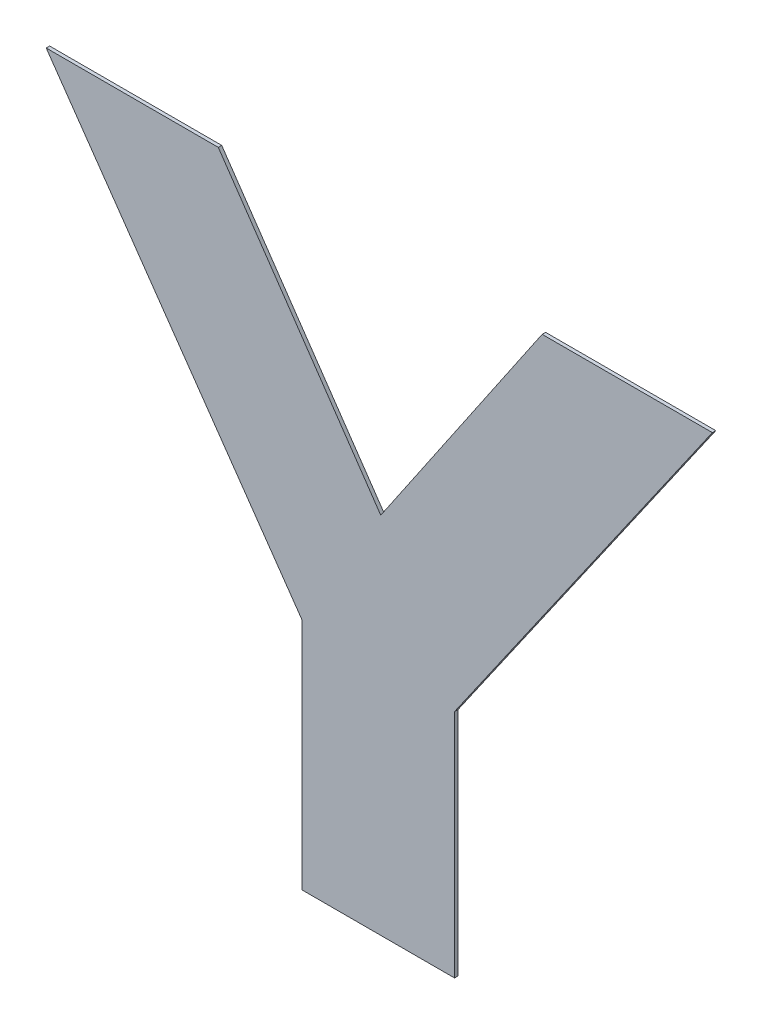
ISO-10303-21;
HEADER;
FILE_DESCRIPTION(('STEP AP214'),'2;1');
FILE_NAME('part.step','',(''),(''),'','','');
FILE_SCHEMA(('AUTOMOTIVE_DESIGN { 1 0 10303 214 1 1 1 1 }'));
ENDSEC;
DATA;
#1=APPLICATION_CONTEXT('core data for automotive mechanical design processes');
#2=APPLICATION_PROTOCOL_DEFINITION('international standard','automotive_design',2000,#1);
#3=PRODUCT_CONTEXT('',#1,'mechanical');
#4=PRODUCT('Part','Part','',(#3));
#5=PRODUCT_RELATED_PRODUCT_CATEGORY('part','',(#4));
#6=PRODUCT_DEFINITION_FORMATION('','',#4);
#7=PRODUCT_DEFINITION_CONTEXT('part definition',#1,'design');
#8=PRODUCT_DEFINITION('design','',#6,#7);
#9=PRODUCT_DEFINITION_SHAPE('','',#8);
#10=(LENGTH_UNIT() NAMED_UNIT(*) SI_UNIT(.MILLI.,.METRE.));
#11=(NAMED_UNIT(*) PLANE_ANGLE_UNIT() SI_UNIT($,.RADIAN.));
#12=(NAMED_UNIT(*) SI_UNIT($,.STERADIAN.) SOLID_ANGLE_UNIT());
#13=UNCERTAINTY_MEASURE_WITH_UNIT(LENGTH_MEASURE(1.E-05),#10,'distance_accuracy_value','');
#14=(GEOMETRIC_REPRESENTATION_CONTEXT(3) GLOBAL_UNCERTAINTY_ASSIGNED_CONTEXT((#13)) GLOBAL_UNIT_ASSIGNED_CONTEXT((#10,
#11,#12)) REPRESENTATION_CONTEXT('',''));
#15=CARTESIAN_POINT('',(0.,0.,0.));
#16=DIRECTION('',(0.,0.,1.));
#17=DIRECTION('',(1.,0.,0.));
#18=AXIS2_PLACEMENT_3D('',#15,#16,#17);
#19=CARTESIAN_POINT('',(0.103085676726,0.828015578792025,0.00045));
#20=DIRECTION('',(-0.820629637441726,-0.571460408210631,0.));
#21=DIRECTION('',(0.,0.,1.));
#22=AXIS2_PLACEMENT_3D('',#19,#20,#21);
#23=PLANE('',#22);
#24=DIRECTION('',(0.,0.,1.));
#25=VECTOR('',#24,1.);
#26=CARTESIAN_POINT('',(0.119836789401,0.803960614837,0.));
#27=LINE('',#26,#25);
#28=CARTESIAN_POINT('',(0.119836789401,0.803960614837,0.));
#29=VERTEX_POINT('',#28);
#30=CARTESIAN_POINT('',(0.119836789401,0.803960614837,0.00045));
#31=VERTEX_POINT('',#30);
#32=EDGE_CURVE('E11',#29,#31,#27,.T.);
#33=ORIENTED_EDGE('',*,*,#32,.T.);
#34=DIRECTION('',(-0.571460408210632,0.820629637441726,0.));
#35=VECTOR('',#34,1.);
#36=CARTESIAN_POINT('',(0.119836789401,0.803960614837,0.00045));
#37=LINE('',#36,#35);
#38=CARTESIAN_POINT('',(0.0863345640509998,0.85207054274705,0.00045));
#39=VERTEX_POINT('',#38);
#40=EDGE_CURVE('E157',#31,#39,#37,.T.);
#41=ORIENTED_EDGE('',*,*,#40,.T.);
#42=DIRECTION('',(0.,0.,1.));
#43=VECTOR('',#42,1.);
#44=CARTESIAN_POINT('',(0.0863345640509998,0.85207054274705,0.));
#45=LINE('',#44,#43);
#46=CARTESIAN_POINT('',(0.0863345640509998,0.85207054274705,0.));
#47=VERTEX_POINT('',#46);
#48=EDGE_CURVE('E24',#47,#39,#45,.T.);
#49=ORIENTED_EDGE('',*,*,#48,.F.);
#50=DIRECTION('',(-0.571460408210632,0.820629637441726,0.));
#51=VECTOR('',#50,1.);
#52=CARTESIAN_POINT('',(0.119836789401,0.803960614837,0.));
#53=LINE('',#52,#51);
#54=EDGE_CURVE('E146',#29,#47,#53,.T.);
#55=ORIENTED_EDGE('',*,*,#54,.F.);
#56=EDGE_LOOP('',(#33,#41,#49,#55));
#57=FACE_BOUND('',#56,.T.);
#58=ADVANCED_FACE('F17',(#57),#23,.T.);
#59=CARTESIAN_POINT('',(0.0976103257259998,0.85207054274705,0.00045));
#60=DIRECTION('',(0.,1.,0.));
#61=DIRECTION('',(0.,0.,1.));
#62=AXIS2_PLACEMENT_3D('',#59,#60,#61);
#63=PLANE('',#62);
#64=ORIENTED_EDGE('',*,*,#48,.T.);
#65=DIRECTION('',(1.,0.,0.));
#66=VECTOR('',#65,1.);
#67=CARTESIAN_POINT('',(0.0863345640509998,0.85207054274705,0.00045));
#68=LINE('',#67,#66);
#69=CARTESIAN_POINT('',(0.108886087401,0.85207054274705,0.00045));
#70=VERTEX_POINT('',#69);
#71=EDGE_CURVE('E153',#39,#70,#68,.T.);
#72=ORIENTED_EDGE('',*,*,#71,.T.);
#73=DIRECTION('',(0.,0.,1.));
#74=VECTOR('',#73,1.);
#75=CARTESIAN_POINT('',(0.108886087401,0.85207054274705,0.));
#76=LINE('',#75,#74);
#77=CARTESIAN_POINT('',(0.108886087401,0.85207054274705,0.));
#78=VERTEX_POINT('',#77);
#79=EDGE_CURVE('E155',#78,#70,#76,.T.);
#80=ORIENTED_EDGE('',*,*,#79,.F.);
#81=DIRECTION('',(1.,0.,0.));
#82=VECTOR('',#81,1.);
#83=CARTESIAN_POINT('',(0.0863345640509998,0.85207054274705,0.));
#84=LINE('',#83,#82);
#85=EDGE_CURVE('E138',#47,#78,#84,.T.);
#86=ORIENTED_EDGE('',*,*,#85,.F.);
#87=EDGE_LOOP('',(#64,#72,#80,#86));
#88=FACE_BOUND('',#87,.T.);
#89=ADVANCED_FACE('F164',(#88),#63,.T.);
#90=CARTESIAN_POINT('',(0.119532033851025,0.836518114809525,0.00045));
#91=DIRECTION('',(0.8251882666148,0.564857791520363,0.));
#92=DIRECTION('',(0.,0.,-1.));
#93=AXIS2_PLACEMENT_3D('',#90,#91,#92);
#94=PLANE('',#93);
#95=ORIENTED_EDGE('',*,*,#79,.T.);
#96=DIRECTION('',(0.564857791520364,-0.825188266614799,0.));
#97=VECTOR('',#96,1.);
#98=CARTESIAN_POINT('',(0.108886087401,0.85207054274705,0.00045));
#99=LINE('',#98,#97);
#100=CARTESIAN_POINT('',(0.13017798030105,0.820965686872,0.00045));
#101=VERTEX_POINT('',#100);
#102=EDGE_CURVE('E148',#70,#101,#99,.T.);
#103=ORIENTED_EDGE('',*,*,#102,.T.);
#104=DIRECTION('',(0.,0.,1.));
#105=VECTOR('',#104,1.);
#106=CARTESIAN_POINT('',(0.13017798030105,0.820965686872,0.));
#107=LINE('',#106,#105);
#108=CARTESIAN_POINT('',(0.13017798030105,0.820965686872,0.));
#109=VERTEX_POINT('',#108);
#110=EDGE_CURVE('E151',#109,#101,#107,.T.);
#111=ORIENTED_EDGE('',*,*,#110,.F.);
#112=DIRECTION('',(0.564857791520364,-0.825188266614799,0.));
#113=VECTOR('',#112,1.);
#114=CARTESIAN_POINT('',(0.108886087401,0.85207054274705,0.));
#115=LINE('',#114,#113);
#116=EDGE_CURVE('E130',#78,#109,#115,.T.);
#117=ORIENTED_EDGE('',*,*,#116,.F.);
#118=EDGE_LOOP('',(#95,#103,#111,#117));
#119=FACE_BOUND('',#118,.T.);
#120=ADVANCED_FACE('F167',(#119),#94,.T.);
#121=CARTESIAN_POINT('',(0.140752819451025,0.836518114809525,0.00045));
#122=DIRECTION('',(-0.826946573811709,0.562280503006352,0.));
#123=DIRECTION('',(0.,0.,1.));
#124=AXIS2_PLACEMENT_3D('',#121,#122,#123);
#125=PLANE('',#124);
#126=ORIENTED_EDGE('',*,*,#110,.T.);
#127=DIRECTION('',(0.562280503006353,0.826946573811708,0.));
#128=VECTOR('',#127,1.);
#129=CARTESIAN_POINT('',(0.13017798030105,0.820965686872,0.00045));
#130=LINE('',#129,#128);
#131=CARTESIAN_POINT('',(0.151327658601,0.85207054274705,0.00045));
#132=VERTEX_POINT('',#131);
#133=EDGE_CURVE('E141',#101,#132,#130,.T.);
#134=ORIENTED_EDGE('',*,*,#133,.T.);
#135=DIRECTION('',(0.,0.,1.));
#136=VECTOR('',#135,1.);
#137=CARTESIAN_POINT('',(0.151327658601,0.85207054274705,0.));
#138=LINE('',#137,#136);
#139=CARTESIAN_POINT('',(0.151327658601,0.85207054274705,0.));
#140=VERTEX_POINT('',#139);
#141=EDGE_CURVE('E144',#140,#132,#138,.T.);
#142=ORIENTED_EDGE('',*,*,#141,.F.);
#143=DIRECTION('',(0.562280503006353,0.826946573811708,0.));
#144=VECTOR('',#143,1.);
#145=CARTESIAN_POINT('',(0.13017798030105,0.820965686872,0.));
#146=LINE('',#145,#144);
#147=EDGE_CURVE('E122',#109,#140,#146,.T.);
#148=ORIENTED_EDGE('',*,*,#147,.F.);
#149=EDGE_LOOP('',(#126,#134,#142,#148));
#150=FACE_BOUND('',#149,.T.);
#151=ADVANCED_FACE('F171',(#150),#125,.T.);
#152=CARTESIAN_POINT('',(0.162481522500975,0.85207054274705,0.00045));
#153=DIRECTION('',(0.,1.,0.));
#154=DIRECTION('',(0.,0.,1.));
#155=AXIS2_PLACEMENT_3D('',#152,#153,#154);
#156=PLANE('',#155);
#157=ORIENTED_EDGE('',*,*,#141,.T.);
#158=DIRECTION('',(1.,0.,0.));
#159=VECTOR('',#158,1.);
#160=CARTESIAN_POINT('',(0.151327658601,0.85207054274705,0.00045));
#161=LINE('',#160,#159);
#162=CARTESIAN_POINT('',(0.17363538640095,0.85207054274705,0.00045));
#163=VERTEX_POINT('',#162);
#164=EDGE_CURVE('E133',#132,#163,#161,.T.);
#165=ORIENTED_EDGE('',*,*,#164,.T.);
#166=DIRECTION('',(0.,0.,1.));
#167=VECTOR('',#166,1.);
#168=CARTESIAN_POINT('',(0.17363538640095,0.85207054274705,0.));
#169=LINE('',#168,#167);
#170=CARTESIAN_POINT('',(0.17363538640095,0.85207054274705,0.));
#171=VERTEX_POINT('',#170);
#172=EDGE_CURVE('E136',#171,#163,#169,.T.);
#173=ORIENTED_EDGE('',*,*,#172,.F.);
#174=DIRECTION('',(1.,0.,0.));
#175=VECTOR('',#174,1.);
#176=CARTESIAN_POINT('',(0.151327658601,0.85207054274705,0.));
#177=LINE('',#176,#175);
#178=EDGE_CURVE('E95',#140,#171,#177,.T.);
#179=ORIENTED_EDGE('',*,*,#178,.F.);
#180=EDGE_LOOP('',(#157,#165,#173,#179));
#181=FACE_BOUND('',#180,.T.);
#182=ADVANCED_FACE('F174',(#181),#156,.T.);
#183=CARTESIAN_POINT('',(0.15674205595095,0.827792095304524,0.00045));
#184=DIRECTION('',(0.820842183617819,-0.571155066154131,0.));
#185=DIRECTION('',(0.,0.,-1.));
#186=AXIS2_PLACEMENT_3D('',#183,#184,#185);
#187=PLANE('',#186);
#188=ORIENTED_EDGE('',*,*,#172,.T.);
#189=DIRECTION('',(-0.571155066154132,-0.820842183617819,0.));
#190=VECTOR('',#189,1.);
#191=CARTESIAN_POINT('',(0.17363538640095,0.85207054274705,0.00045));
#192=LINE('',#191,#190);
#193=CARTESIAN_POINT('',(0.13984872550095,0.803513647861999,0.00045));
#194=VERTEX_POINT('',#193);
#195=EDGE_CURVE('E125',#163,#194,#192,.T.);
#196=ORIENTED_EDGE('',*,*,#195,.T.);
#197=DIRECTION('',(0.,0.,1.));
#198=VECTOR('',#197,1.);
#199=CARTESIAN_POINT('',(0.13984872550095,0.803513647861999,0.));
#200=LINE('',#199,#198);
#201=CARTESIAN_POINT('',(0.13984872550095,0.803513647861999,0.));
#202=VERTEX_POINT('',#201);
#203=EDGE_CURVE('E128',#202,#194,#200,.T.);
#204=ORIENTED_EDGE('',*,*,#203,.F.);
#205=DIRECTION('',(-0.571155066154132,-0.820842183617819,0.));
#206=VECTOR('',#205,1.);
#207=CARTESIAN_POINT('',(0.17363538640095,0.85207054274705,0.));
#208=LINE('',#207,#206);
#209=EDGE_CURVE('E112',#171,#202,#208,.T.);
#210=ORIENTED_EDGE('',*,*,#209,.F.);
#211=EDGE_LOOP('',(#188,#196,#204,#210));
#212=FACE_BOUND('',#211,.T.);
#213=ADVANCED_FACE('F178',(#212),#187,.T.);
#214=CARTESIAN_POINT('',(0.13984872550095,0.788397013121974,0.00045));
#215=DIRECTION('',(1.,0.,0.));
#216=DIRECTION('',(0.,0.,-1.));
#217=AXIS2_PLACEMENT_3D('',#214,#215,#216);
#218=PLANE('',#217);
#219=ORIENTED_EDGE('',*,*,#203,.T.);
#220=DIRECTION('',(0.,-1.,0.));
#221=VECTOR('',#220,1.);
#222=CARTESIAN_POINT('',(0.13984872550095,0.803513647861999,0.00045));
#223=LINE('',#222,#221);
#224=CARTESIAN_POINT('',(0.13984872550095,0.77328037838195,0.00045));
#225=VERTEX_POINT('',#224);
#226=EDGE_CURVE('E117',#194,#225,#223,.T.);
#227=ORIENTED_EDGE('',*,*,#226,.T.);
#228=DIRECTION('',(0.,0.,1.));
#229=VECTOR('',#228,1.);
#230=CARTESIAN_POINT('',(0.13984872550095,0.77328037838195,0.));
#231=LINE('',#230,#229);
#232=CARTESIAN_POINT('',(0.13984872550095,0.77328037838195,0.));
#233=VERTEX_POINT('',#232);
#234=EDGE_CURVE('E120',#233,#225,#231,.T.);
#235=ORIENTED_EDGE('',*,*,#234,.F.);
#236=DIRECTION('',(0.,-1.,0.));
#237=VECTOR('',#236,1.);
#238=CARTESIAN_POINT('',(0.13984872550095,0.803513647861999,0.));
#239=LINE('',#238,#237);
#240=EDGE_CURVE('E106',#202,#233,#239,.T.);
#241=ORIENTED_EDGE('',*,*,#240,.F.);
#242=EDGE_LOOP('',(#219,#227,#235,#241));
#243=FACE_BOUND('',#242,.T.);
#244=ADVANCED_FACE('F181',(#243),#218,.T.);
#245=CARTESIAN_POINT('',(0.129842757450975,0.77328037838195,0.00045));
#246=DIRECTION('',(0.,-1.,0.));
#247=DIRECTION('',(0.,0.,-1.));
#248=AXIS2_PLACEMENT_3D('',#245,#246,#247);
#249=PLANE('',#248);
#250=ORIENTED_EDGE('',*,*,#234,.T.);
#251=DIRECTION('',(-1.,0.,0.));
#252=VECTOR('',#251,1.);
#253=CARTESIAN_POINT('',(0.13984872550095,0.77328037838195,0.00045));
#254=LINE('',#253,#252);
#255=CARTESIAN_POINT('',(0.119836789401,0.77328037838195,0.00045));
#256=VERTEX_POINT('',#255);
#257=EDGE_CURVE('E92',#225,#256,#254,.T.);
#258=ORIENTED_EDGE('',*,*,#257,.T.);
#259=DIRECTION('',(0.,0.,1.));
#260=VECTOR('',#259,1.);
#261=CARTESIAN_POINT('',(0.119836789401,0.77328037838195,0.));
#262=LINE('',#261,#260);
#263=CARTESIAN_POINT('',(0.119836789401,0.77328037838195,0.));
#264=VERTEX_POINT('',#263);
#265=EDGE_CURVE('E85',#264,#256,#262,.T.);
#266=ORIENTED_EDGE('',*,*,#265,.F.);
#267=DIRECTION('',(-1.,0.,0.));
#268=VECTOR('',#267,1.);
#269=CARTESIAN_POINT('',(0.13984872550095,0.77328037838195,0.));
#270=LINE('',#269,#268);
#271=EDGE_CURVE('E89',#233,#264,#270,.T.);
#272=ORIENTED_EDGE('',*,*,#271,.F.);
#273=EDGE_LOOP('',(#250,#258,#266,#272));
#274=FACE_BOUND('',#273,.T.);
#275=ADVANCED_FACE('F87',(#274),#249,.T.);
#276=CARTESIAN_POINT('',(0.119836789401,0.788620496609475,0.00045));
#277=DIRECTION('',(-1.,0.,0.));
#278=DIRECTION('',(0.,0.,1.));
#279=AXIS2_PLACEMENT_3D('',#276,#277,#278);
#280=PLANE('',#279);
#281=ORIENTED_EDGE('',*,*,#265,.T.);
#282=DIRECTION('',(0.,1.,0.));
#283=VECTOR('',#282,1.);
#284=CARTESIAN_POINT('',(0.119836789401,0.77328037838195,0.00045));
#285=LINE('',#284,#283);
#286=EDGE_CURVE('E108',#256,#31,#285,.T.);
#287=ORIENTED_EDGE('',*,*,#286,.T.);
#288=ORIENTED_EDGE('',*,*,#32,.F.);
#289=DIRECTION('',(0.,1.,0.));
#290=VECTOR('',#289,1.);
#291=CARTESIAN_POINT('',(0.119836789401,0.77328037838195,0.));
#292=LINE('',#291,#290);
#293=EDGE_CURVE('E98',#264,#29,#292,.T.);
#294=ORIENTED_EDGE('',*,*,#293,.F.);
#295=EDGE_LOOP('',(#281,#287,#288,#294));
#296=FACE_BOUND('',#295,.T.);
#297=ADVANCED_FACE('F99',(#296),#280,.T.);
#298=CARTESIAN_POINT('',(0.129984975225975,0.77328037838195,0.));
#299=DIRECTION('',(0.,0.,1.));
#300=DIRECTION('',(1.,0.,0.));
#301=AXIS2_PLACEMENT_3D('',#298,#299,#300);
#302=PLANE('',#301);
#303=ORIENTED_EDGE('',*,*,#54,.T.);
#304=ORIENTED_EDGE('',*,*,#85,.T.);
#305=ORIENTED_EDGE('',*,*,#116,.T.);
#306=ORIENTED_EDGE('',*,*,#147,.T.);
#307=ORIENTED_EDGE('',*,*,#178,.T.);
#308=ORIENTED_EDGE('',*,*,#209,.T.);
#309=ORIENTED_EDGE('',*,*,#240,.T.);
#310=ORIENTED_EDGE('',*,*,#271,.T.);
#311=ORIENTED_EDGE('',*,*,#293,.T.);
#312=EDGE_LOOP('',(#303,#304,#305,#306,#307,#308,#309,#310,#311));
#313=FACE_BOUND('',#312,.T.);
#314=ADVANCED_FACE('F103',(#313),#302,.F.);
#315=CARTESIAN_POINT('',(0.129984975225975,0.77328037838195,0.00045));
#316=DIRECTION('',(0.,0.,1.));
#317=DIRECTION('',(1.,0.,0.));
#318=AXIS2_PLACEMENT_3D('',#315,#316,#317);
#319=PLANE('',#318);
#320=ORIENTED_EDGE('',*,*,#40,.F.);
#321=ORIENTED_EDGE('',*,*,#286,.F.);
#322=ORIENTED_EDGE('',*,*,#257,.F.);
#323=ORIENTED_EDGE('',*,*,#226,.F.);
#324=ORIENTED_EDGE('',*,*,#195,.F.);
#325=ORIENTED_EDGE('',*,*,#164,.F.);
#326=ORIENTED_EDGE('',*,*,#133,.F.);
#327=ORIENTED_EDGE('',*,*,#102,.F.);
#328=ORIENTED_EDGE('',*,*,#71,.F.);
#329=EDGE_LOOP('',(#320,#321,#322,#323,#324,#325,#326,#327,#328));
#330=FACE_BOUND('',#329,.T.);
#331=ADVANCED_FACE('F162',(#330),#319,.T.);
#332=CLOSED_SHELL('',(#58,#89,#120,#151,#182,#213,#244,#275,#297,#314,#331));
#333=MANIFOLD_SOLID_BREP('B1',#332);
#334=ADVANCED_BREP_SHAPE_REPRESENTATION('',(#18,#333),#14);
#335=SHAPE_DEFINITION_REPRESENTATION(#9,#334);
ENDSEC;
END-ISO-10303-21;
